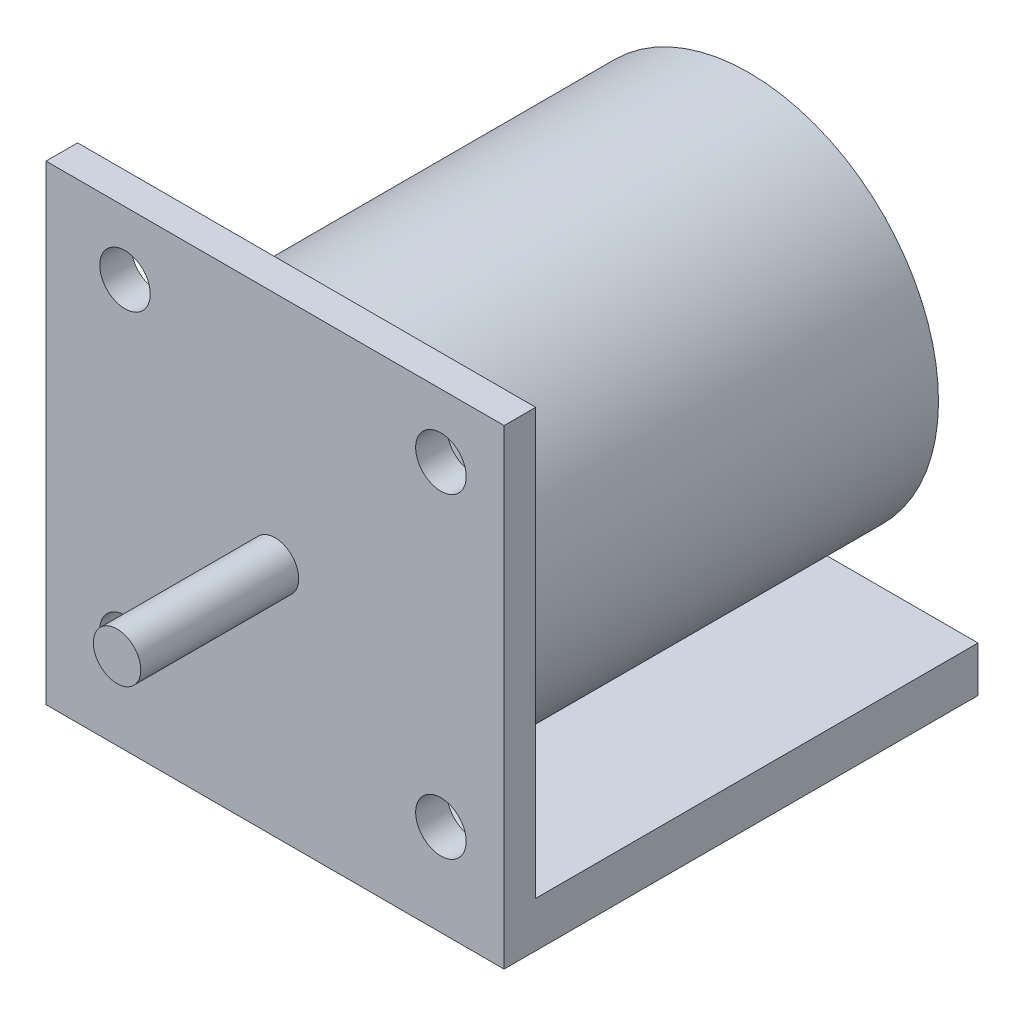
ISO-10303-21;
HEADER;
FILE_DESCRIPTION(('STEP AP214'),'2;1');
FILE_NAME('part.step','',(''),(''),'','','');
FILE_SCHEMA(('AUTOMOTIVE_DESIGN { 1 0 10303 214 1 1 1 1 }'));
ENDSEC;
DATA;
#1=APPLICATION_CONTEXT('core data for automotive mechanical design processes');
#2=APPLICATION_PROTOCOL_DEFINITION('international standard','automotive_design',2000,#1);
#3=PRODUCT_CONTEXT('',#1,'mechanical');
#4=PRODUCT('Part','Part','',(#3));
#5=PRODUCT_RELATED_PRODUCT_CATEGORY('part','',(#4));
#6=PRODUCT_DEFINITION_FORMATION('','',#4);
#7=PRODUCT_DEFINITION_CONTEXT('part definition',#1,'design');
#8=PRODUCT_DEFINITION('design','',#6,#7);
#9=PRODUCT_DEFINITION_SHAPE('','',#8);
#10=(LENGTH_UNIT() NAMED_UNIT(*) SI_UNIT(.MILLI.,.METRE.));
#11=(NAMED_UNIT(*) PLANE_ANGLE_UNIT() SI_UNIT($,.RADIAN.));
#12=(NAMED_UNIT(*) SI_UNIT($,.STERADIAN.) SOLID_ANGLE_UNIT());
#13=UNCERTAINTY_MEASURE_WITH_UNIT(LENGTH_MEASURE(1.E-05),#10,'distance_accuracy_value','');
#14=(GEOMETRIC_REPRESENTATION_CONTEXT(3) GLOBAL_UNCERTAINTY_ASSIGNED_CONTEXT((#13)) GLOBAL_UNIT_ASSIGNED_CONTEXT((#10,
#11,#12)) REPRESENTATION_CONTEXT('',''));
#15=CARTESIAN_POINT('',(0.,0.,0.));
#16=DIRECTION('',(0.,0.,1.));
#17=DIRECTION('',(1.,0.,0.));
#18=AXIS2_PLACEMENT_3D('',#15,#16,#17);
#19=CARTESIAN_POINT('',(0.,0.,0.));
#20=DIRECTION('',(0.,0.,-1.));
#21=DIRECTION('',(-1.,0.,0.));
#22=AXIS2_PLACEMENT_3D('',#19,#20,#21);
#23=PLANE('',#22);
#24=CARTESIAN_POINT('',(-12.0649999999997,-11.5570000000002,0.));
#25=DIRECTION('',(0.,0.,-1.));
#26=DIRECTION('',(-1.,0.,0.));
#27=AXIS2_PLACEMENT_3D('',#24,#25,#26);
#28=CIRCLE('',#27,2.032);
#29=CARTESIAN_POINT('',(-10.0348667645362,-11.4699193117478,0.));
#30=VERTEX_POINT('',#29);
#31=CARTESIAN_POINT('',(-11.890722626426,-9.5324873680168,0.));
#32=VERTEX_POINT('',#31);
#33=EDGE_CURVE('E112',#30,#32,#28,.T.);
#34=ORIENTED_EDGE('',*,*,#33,.F.);
#35=CARTESIAN_POINT('',(0.,0.,0.));
#36=DIRECTION('',(0.,0.,-1.));
#37=DIRECTION('',(-1.,0.,0.));
#38=AXIS2_PLACEMENT_3D('',#35,#36,#37);
#39=CIRCLE('',#38,15.24);
#40=EDGE_CURVE('E119',#32,#30,#39,.T.);
#41=ORIENTED_EDGE('',*,*,#40,.F.);
#42=EDGE_LOOP('',(#34,#41));
#43=FACE_BOUND('',#42,.T.);
#44=CARTESIAN_POINT('',(13.3350000000003,-11.557,0.));
#45=DIRECTION('',(0.,0.,-1.));
#46=DIRECTION('',(-1.,0.,0.));
#47=AXIS2_PLACEMENT_3D('',#44,#45,#46);
#48=CIRCLE('',#47,2.032);
#49=CARTESIAN_POINT('',(11.3030000000003,-11.557,0.));
#50=VERTEX_POINT('',#49);
#51=EDGE_CURVE('E333',#50,#50,#48,.T.);
#52=ORIENTED_EDGE('',*,*,#51,.F.);
#53=EDGE_LOOP('',(#52));
#54=FACE_BOUND('',#53,.T.);
#55=CARTESIAN_POINT('',(-12.065,13.8429999999998,0.));
#56=DIRECTION('',(0.,0.,-1.));
#57=DIRECTION('',(-1.,0.,0.));
#58=AXIS2_PLACEMENT_3D('',#55,#56,#57);
#59=CIRCLE('',#58,2.032);
#60=CARTESIAN_POINT('',(-14.097,13.8429999999998,0.));
#61=VERTEX_POINT('',#60);
#62=EDGE_CURVE('E339',#61,#61,#59,.T.);
#63=ORIENTED_EDGE('',*,*,#62,.F.);
#64=EDGE_LOOP('',(#63));
#65=FACE_BOUND('',#64,.T.);
#66=CARTESIAN_POINT('',(13.335,13.843,0.));
#67=DIRECTION('',(0.,0.,-1.));
#68=DIRECTION('',(-1.,0.,0.));
#69=AXIS2_PLACEMENT_3D('',#66,#67,#68);
#70=CIRCLE('',#69,2.032);
#71=CARTESIAN_POINT('',(11.303,13.843,0.));
#72=VERTEX_POINT('',#71);
#73=EDGE_CURVE('E345',#72,#72,#70,.T.);
#74=ORIENTED_EDGE('',*,*,#73,.F.);
#75=EDGE_LOOP('',(#74));
#76=FACE_BOUND('',#75,.T.);
#77=DIRECTION('',(0.,1.,0.));
#78=VECTOR('',#77,1.);
#79=CARTESIAN_POINT('',(18.415,-18.923,0.));
#80=LINE('',#79,#78);
#81=CARTESIAN_POINT('',(18.415,-15.2655964007522,0.));
#82=VERTEX_POINT('',#81);
#83=CARTESIAN_POINT('',(18.415,18.923,0.));
#84=VERTEX_POINT('',#83);
#85=EDGE_CURVE('E132',#82,#84,#80,.T.);
#86=ORIENTED_EDGE('',*,*,#85,.F.);
#87=DIRECTION('',(1.,0.,0.));
#88=VECTOR('',#87,1.);
#89=CARTESIAN_POINT('',(-18.415,-15.2655964007522,0.));
#90=LINE('',#89,#88);
#91=CARTESIAN_POINT('',(-18.415,-15.2655964007522,0.));
#92=VERTEX_POINT('',#91);
#93=EDGE_CURVE('E348',#92,#82,#90,.T.);
#94=ORIENTED_EDGE('',*,*,#93,.F.);
#95=DIRECTION('',(0.,-1.,0.));
#96=VECTOR('',#95,1.);
#97=CARTESIAN_POINT('',(-18.415,-18.923,0.));
#98=LINE('',#97,#96);
#99=CARTESIAN_POINT('',(-18.415,18.923,0.));
#100=VERTEX_POINT('',#99);
#101=EDGE_CURVE('E135',#100,#92,#98,.T.);
#102=ORIENTED_EDGE('',*,*,#101,.F.);
#103=DIRECTION('',(-1.,0.,0.));
#104=VECTOR('',#103,1.);
#105=CARTESIAN_POINT('',(-18.415,18.923,0.));
#106=LINE('',#105,#104);
#107=EDGE_CURVE('E71',#84,#100,#106,.T.);
#108=ORIENTED_EDGE('',*,*,#107,.F.);
#109=EDGE_LOOP('',(#86,#94,#102,#108));
#110=FACE_BOUND('',#109,.T.);
#111=ADVANCED_FACE('F32',(#43,#54,#65,#76,#110),#23,.T.);
#112=CARTESIAN_POINT('',(0.,0.,2.54));
#113=DIRECTION('',(0.,0.,-1.));
#114=DIRECTION('',(-1.,0.,0.));
#115=AXIS2_PLACEMENT_3D('',#112,#113,#114);
#116=PLANE('',#115);
#117=CARTESIAN_POINT('',(-12.0649999999997,-11.5570000000002,2.54));
#118=DIRECTION('',(0.,0.,1.));
#119=DIRECTION('',(1.,0.,0.));
#120=AXIS2_PLACEMENT_3D('',#117,#118,#119);
#121=CIRCLE('',#120,2.032);
#122=CARTESIAN_POINT('',(-10.0329999999997,-11.5570000000002,2.54));
#123=VERTEX_POINT('',#122);
#124=EDGE_CURVE('E113',#123,#123,#121,.T.);
#125=ORIENTED_EDGE('',*,*,#124,.F.);
#126=EDGE_LOOP('',(#125));
#127=FACE_BOUND('',#126,.T.);
#128=CARTESIAN_POINT('',(13.3350000000003,-11.557,2.54));
#129=DIRECTION('',(0.,0.,1.));
#130=DIRECTION('',(1.,0.,0.));
#131=AXIS2_PLACEMENT_3D('',#128,#129,#130);
#132=CIRCLE('',#131,2.032);
#133=CARTESIAN_POINT('',(15.3670000000003,-11.557,2.54));
#134=VERTEX_POINT('',#133);
#135=EDGE_CURVE('E330',#134,#134,#132,.T.);
#136=ORIENTED_EDGE('',*,*,#135,.F.);
#137=EDGE_LOOP('',(#136));
#138=FACE_BOUND('',#137,.T.);
#139=CARTESIAN_POINT('',(-12.065,13.8429999999998,2.54));
#140=DIRECTION('',(0.,0.,1.));
#141=DIRECTION('',(1.,0.,0.));
#142=AXIS2_PLACEMENT_3D('',#139,#140,#141);
#143=CIRCLE('',#142,2.032);
#144=CARTESIAN_POINT('',(-10.033,13.8429999999998,2.54));
#145=VERTEX_POINT('',#144);
#146=EDGE_CURVE('E336',#145,#145,#143,.T.);
#147=ORIENTED_EDGE('',*,*,#146,.F.);
#148=EDGE_LOOP('',(#147));
#149=FACE_BOUND('',#148,.T.);
#150=CARTESIAN_POINT('',(13.335,13.843,2.54));
#151=DIRECTION('',(0.,0.,1.));
#152=DIRECTION('',(1.,0.,0.));
#153=AXIS2_PLACEMENT_3D('',#150,#151,#152);
#154=CIRCLE('',#153,2.032);
#155=CARTESIAN_POINT('',(15.367,13.843,2.54));
#156=VERTEX_POINT('',#155);
#157=EDGE_CURVE('E342',#156,#156,#154,.T.);
#158=ORIENTED_EDGE('',*,*,#157,.F.);
#159=EDGE_LOOP('',(#158));
#160=FACE_BOUND('',#159,.T.);
#161=DIRECTION('',(0.,1.,0.));
#162=VECTOR('',#161,1.);
#163=CARTESIAN_POINT('',(18.415,-18.923,2.54));
#164=LINE('',#163,#162);
#165=CARTESIAN_POINT('',(18.415,-18.923,2.54));
#166=VERTEX_POINT('',#165);
#167=CARTESIAN_POINT('',(18.415,18.923,2.54));
#168=VERTEX_POINT('',#167);
#169=EDGE_CURVE('E133',#166,#168,#164,.T.);
#170=ORIENTED_EDGE('',*,*,#169,.T.);
#171=DIRECTION('',(-1.,0.,0.));
#172=VECTOR('',#171,1.);
#173=CARTESIAN_POINT('',(-18.415,18.923,2.54));
#174=LINE('',#173,#172);
#175=CARTESIAN_POINT('',(-18.415,18.923,2.54));
#176=VERTEX_POINT('',#175);
#177=EDGE_CURVE('E76',#168,#176,#174,.T.);
#178=ORIENTED_EDGE('',*,*,#177,.T.);
#179=DIRECTION('',(0.,-1.,0.));
#180=VECTOR('',#179,1.);
#181=CARTESIAN_POINT('',(-18.415,-18.923,2.54));
#182=LINE('',#181,#180);
#183=CARTESIAN_POINT('',(-18.415,-18.923,2.54));
#184=VERTEX_POINT('',#183);
#185=EDGE_CURVE('E137',#176,#184,#182,.T.);
#186=ORIENTED_EDGE('',*,*,#185,.T.);
#187=DIRECTION('',(1.,0.,0.));
#188=VECTOR('',#187,1.);
#189=CARTESIAN_POINT('',(-18.415,-18.923,2.54));
#190=LINE('',#189,#188);
#191=EDGE_CURVE('E55',#184,#166,#190,.T.);
#192=ORIENTED_EDGE('',*,*,#191,.T.);
#193=EDGE_LOOP('',(#170,#178,#186,#192));
#194=FACE_BOUND('',#193,.T.);
#195=CARTESIAN_POINT('',(0.,0.,2.54));
#196=DIRECTION('',(0.,0.,-1.));
#197=DIRECTION('',(-1.,0.,0.));
#198=AXIS2_PLACEMENT_3D('',#195,#196,#197);
#199=CIRCLE('',#198,1.905);
#200=CARTESIAN_POINT('',(-1.905,0.,2.54));
#201=VERTEX_POINT('',#200);
#202=EDGE_CURVE('E107',#201,#201,#199,.F.);
#203=ORIENTED_EDGE('',*,*,#202,.F.);
#204=EDGE_LOOP('',(#203));
#205=FACE_BOUND('',#204,.T.);
#206=ADVANCED_FACE('F157',(#127,#138,#149,#160,#194,#205),#116,.F.);
#207=CARTESIAN_POINT('',(18.415,-18.923,2.54));
#208=DIRECTION('',(-1.,0.,0.));
#209=DIRECTION('',(0.,0.,1.));
#210=AXIS2_PLACEMENT_3D('',#207,#208,#209);
#211=PLANE('',#210);
#212=DIRECTION('',(0.,0.,-1.));
#213=VECTOR('',#212,1.);
#214=CARTESIAN_POINT('',(18.415,-18.923,2.54));
#215=LINE('',#214,#213);
#216=CARTESIAN_POINT('',(18.415,-18.923,-35.56));
#217=VERTEX_POINT('',#216);
#218=EDGE_CURVE('E140',#166,#217,#215,.T.);
#219=ORIENTED_EDGE('',*,*,#218,.T.);
#220=DIRECTION('',(0.,-1.,0.));
#221=VECTOR('',#220,1.);
#222=CARTESIAN_POINT('',(18.415,-18.923,-35.56));
#223=LINE('',#222,#221);
#224=CARTESIAN_POINT('',(18.415,-15.2655964007522,-35.56));
#225=VERTEX_POINT('',#224);
#226=EDGE_CURVE('E354',#225,#217,#223,.T.);
#227=ORIENTED_EDGE('',*,*,#226,.F.);
#228=DIRECTION('',(0.,0.,1.));
#229=VECTOR('',#228,1.);
#230=CARTESIAN_POINT('',(18.415,-15.2655964007522,-35.56));
#231=LINE('',#230,#229);
#232=EDGE_CURVE('E127',#225,#82,#231,.T.);
#233=ORIENTED_EDGE('',*,*,#232,.T.);
#234=ORIENTED_EDGE('',*,*,#85,.T.);
#235=DIRECTION('',(0.,0.,-1.));
#236=VECTOR('',#235,1.);
#237=CARTESIAN_POINT('',(18.415,18.923,2.54));
#238=LINE('',#237,#236);
#239=EDGE_CURVE('E150',#168,#84,#238,.T.);
#240=ORIENTED_EDGE('',*,*,#239,.F.);
#241=ORIENTED_EDGE('',*,*,#169,.F.);
#242=EDGE_LOOP('',(#219,#227,#233,#234,#240,#241));
#243=FACE_BOUND('',#242,.T.);
#244=ADVANCED_FACE('F34',(#243),#211,.F.);
#245=CARTESIAN_POINT('',(-18.415,18.923,2.54));
#246=DIRECTION('',(0.,-1.,0.));
#247=DIRECTION('',(0.,0.,-1.));
#248=AXIS2_PLACEMENT_3D('',#245,#246,#247);
#249=PLANE('',#248);
#250=ORIENTED_EDGE('',*,*,#107,.T.);
#251=DIRECTION('',(0.,0.,-1.));
#252=VECTOR('',#251,1.);
#253=CARTESIAN_POINT('',(-18.415,18.923,2.54));
#254=LINE('',#253,#252);
#255=EDGE_CURVE('E148',#176,#100,#254,.T.);
#256=ORIENTED_EDGE('',*,*,#255,.F.);
#257=ORIENTED_EDGE('',*,*,#177,.F.);
#258=ORIENTED_EDGE('',*,*,#239,.T.);
#259=EDGE_LOOP('',(#250,#256,#257,#258));
#260=FACE_BOUND('',#259,.T.);
#261=ADVANCED_FACE('F165',(#260),#249,.F.);
#262=CARTESIAN_POINT('',(-18.415,-18.923,2.54));
#263=DIRECTION('',(1.,0.,0.));
#264=DIRECTION('',(0.,0.,-1.));
#265=AXIS2_PLACEMENT_3D('',#262,#263,#264);
#266=PLANE('',#265);
#267=ORIENTED_EDGE('',*,*,#101,.T.);
#268=DIRECTION('',(0.,0.,1.));
#269=VECTOR('',#268,1.);
#270=CARTESIAN_POINT('',(-18.415,-15.2655964007522,-35.56));
#271=LINE('',#270,#269);
#272=CARTESIAN_POINT('',(-18.415,-15.2655964007522,-35.56));
#273=VERTEX_POINT('',#272);
#274=EDGE_CURVE('E122',#273,#92,#271,.T.);
#275=ORIENTED_EDGE('',*,*,#274,.F.);
#276=DIRECTION('',(0.,1.,0.));
#277=VECTOR('',#276,1.);
#278=CARTESIAN_POINT('',(-18.415,-18.923,-35.56));
#279=LINE('',#278,#277);
#280=CARTESIAN_POINT('',(-18.415,-18.923,-35.56));
#281=VERTEX_POINT('',#280);
#282=EDGE_CURVE('E349',#281,#273,#279,.T.);
#283=ORIENTED_EDGE('',*,*,#282,.F.);
#284=DIRECTION('',(0.,0.,-1.));
#285=VECTOR('',#284,1.);
#286=CARTESIAN_POINT('',(-18.415,-18.923,2.54));
#287=LINE('',#286,#285);
#288=EDGE_CURVE('E146',#184,#281,#287,.T.);
#289=ORIENTED_EDGE('',*,*,#288,.F.);
#290=ORIENTED_EDGE('',*,*,#185,.F.);
#291=ORIENTED_EDGE('',*,*,#255,.T.);
#292=EDGE_LOOP('',(#267,#275,#283,#289,#290,#291));
#293=FACE_BOUND('',#292,.T.);
#294=ADVANCED_FACE('F176',(#293),#266,.F.);
#295=CARTESIAN_POINT('',(-18.415,-18.923,2.54));
#296=DIRECTION('',(0.,1.,0.));
#297=DIRECTION('',(0.,0.,1.));
#298=AXIS2_PLACEMENT_3D('',#295,#296,#297);
#299=PLANE('',#298);
#300=ORIENTED_EDGE('',*,*,#288,.T.);
#301=DIRECTION('',(-1.,0.,0.));
#302=VECTOR('',#301,1.);
#303=CARTESIAN_POINT('',(-18.415,-18.923,-35.56));
#304=LINE('',#303,#302);
#305=EDGE_CURVE('E357',#217,#281,#304,.T.);
#306=ORIENTED_EDGE('',*,*,#305,.F.);
#307=ORIENTED_EDGE('',*,*,#218,.F.);
#308=ORIENTED_EDGE('',*,*,#191,.F.);
#309=EDGE_LOOP('',(#300,#306,#307,#308));
#310=FACE_BOUND('',#309,.T.);
#311=ADVANCED_FACE('F173',(#310),#299,.F.);
#312=CARTESIAN_POINT('',(0.,0.,15.24));
#313=DIRECTION('',(0.,0.,-1.));
#314=DIRECTION('',(-1.,0.,0.));
#315=AXIS2_PLACEMENT_3D('',#312,#313,#314);
#316=CYLINDRICAL_SURFACE('',#315,1.905);
#317=CARTESIAN_POINT('',(0.,0.,15.24));
#318=DIRECTION('',(0.,0.,1.));
#319=DIRECTION('',(1.,0.,0.));
#320=AXIS2_PLACEMENT_3D('',#317,#318,#319);
#321=CIRCLE('',#320,1.905);
#322=CARTESIAN_POINT('',(1.905,0.,15.24));
#323=VERTEX_POINT('',#322);
#324=EDGE_CURVE('E125',#323,#323,#321,.T.);
#325=ORIENTED_EDGE('',*,*,#324,.F.);
#326=EDGE_LOOP('',(#325));
#327=FACE_BOUND('',#326,.T.);
#328=ORIENTED_EDGE('',*,*,#202,.T.);
#329=EDGE_LOOP('',(#328));
#330=FACE_BOUND('',#329,.T.);
#331=ADVANCED_FACE('F155',(#327,#330),#316,.T.);
#332=CARTESIAN_POINT('',(0.,0.,15.24));
#333=DIRECTION('',(0.,0.,1.));
#334=DIRECTION('',(1.,0.,0.));
#335=AXIS2_PLACEMENT_3D('',#332,#333,#334);
#336=PLANE('',#335);
#337=ORIENTED_EDGE('',*,*,#324,.T.);
#338=EDGE_LOOP('',(#337));
#339=FACE_BOUND('',#338,.T.);
#340=ADVANCED_FACE('F200',(#339),#336,.T.);
#341=CARTESIAN_POINT('',(0.,0.,-35.56));
#342=DIRECTION('',(0.,0.,1.));
#343=DIRECTION('',(1.,0.,0.));
#344=AXIS2_PLACEMENT_3D('',#341,#342,#343);
#345=CYLINDRICAL_SURFACE('',#344,15.24);
#346=ORIENTED_EDGE('',*,*,#40,.T.);
#347=DIRECTION('',(0.,0.,1.));
#348=VECTOR('',#347,1.);
#349=CARTESIAN_POINT('',(-10.0348667645362,-11.4699193117478,-15.24));
#350=LINE('',#349,#348);
#351=CARTESIAN_POINT('',(-10.0348667645362,-11.4699193117478,-33.02));
#352=VERTEX_POINT('',#351);
#353=EDGE_CURVE('E11',#30,#352,#350,.F.);
#354=ORIENTED_EDGE('',*,*,#353,.T.);
#355=CARTESIAN_POINT('',(0.,0.,-33.02));
#356=DIRECTION('',(0.,0.,1.));
#357=DIRECTION('',(1.,0.,0.));
#358=AXIS2_PLACEMENT_3D('',#355,#356,#357);
#359=CIRCLE('',#358,15.24);
#360=CARTESIAN_POINT('',(-11.890722626426,-9.53248736801681,-33.02));
#361=VERTEX_POINT('',#360);
#362=EDGE_CURVE('E103',#361,#352,#359,.T.);
#363=ORIENTED_EDGE('',*,*,#362,.F.);
#364=DIRECTION('',(0.,0.,1.));
#365=VECTOR('',#364,1.);
#366=CARTESIAN_POINT('',(-11.890722626426,-9.53248736801681,-15.24));
#367=LINE('',#366,#365);
#368=EDGE_CURVE('E40',#361,#32,#367,.T.);
#369=ORIENTED_EDGE('',*,*,#368,.T.);
#370=EDGE_LOOP('',(#346,#354,#363,#369));
#371=FACE_BOUND('',#370,.T.);
#372=CARTESIAN_POINT('',(0.,0.,-35.56));
#373=DIRECTION('',(0.,0.,-1.));
#374=DIRECTION('',(-1.,0.,0.));
#375=AXIS2_PLACEMENT_3D('',#372,#373,#374);
#376=CIRCLE('',#375,15.24);
#377=CARTESIAN_POINT('',(-15.24,0.,-35.56));
#378=VERTEX_POINT('',#377);
#379=EDGE_CURVE('E121',#378,#378,#376,.T.);
#380=ORIENTED_EDGE('',*,*,#379,.F.);
#381=EDGE_LOOP('',(#380));
#382=FACE_BOUND('',#381,.T.);
#383=ADVANCED_FACE('F116',(#371,#382),#345,.T.);
#384=CARTESIAN_POINT('',(0.,0.,-35.56));
#385=DIRECTION('',(0.,0.,-1.));
#386=DIRECTION('',(-1.,0.,0.));
#387=AXIS2_PLACEMENT_3D('',#384,#385,#386);
#388=PLANE('',#387);
#389=ORIENTED_EDGE('',*,*,#379,.T.);
#390=EDGE_LOOP('',(#389));
#391=FACE_BOUND('',#390,.T.);
#392=ADVANCED_FACE('F214',(#391),#388,.T.);
#393=CARTESIAN_POINT('',(-18.415,-15.2655964007522,-35.56));
#394=DIRECTION('',(0.,-1.,0.));
#395=DIRECTION('',(0.,0.,-1.));
#396=AXIS2_PLACEMENT_3D('',#393,#394,#395);
#397=PLANE('',#396);
#398=ORIENTED_EDGE('',*,*,#93,.T.);
#399=ORIENTED_EDGE('',*,*,#232,.F.);
#400=DIRECTION('',(1.,0.,0.));
#401=VECTOR('',#400,1.);
#402=CARTESIAN_POINT('',(-18.415,-15.2655964007522,-35.56));
#403=LINE('',#402,#401);
#404=EDGE_CURVE('E352',#273,#225,#403,.T.);
#405=ORIENTED_EDGE('',*,*,#404,.F.);
#406=ORIENTED_EDGE('',*,*,#274,.T.);
#407=EDGE_LOOP('',(#398,#399,#405,#406));
#408=FACE_BOUND('',#407,.T.);
#409=ADVANCED_FACE('F221',(#408),#397,.F.);
#410=CARTESIAN_POINT('',(0.,0.,-35.56));
#411=DIRECTION('',(0.,0.,-1.));
#412=DIRECTION('',(-1.,0.,0.));
#413=AXIS2_PLACEMENT_3D('',#410,#411,#412);
#414=PLANE('',#413);
#415=ORIENTED_EDGE('',*,*,#282,.T.);
#416=ORIENTED_EDGE('',*,*,#404,.T.);
#417=ORIENTED_EDGE('',*,*,#226,.T.);
#418=ORIENTED_EDGE('',*,*,#305,.T.);
#419=EDGE_LOOP('',(#415,#416,#417,#418));
#420=FACE_BOUND('',#419,.T.);
#421=ADVANCED_FACE('F228',(#420),#414,.T.);
#422=CARTESIAN_POINT('',(13.335,13.843,-33.02));
#423=DIRECTION('',(0.,0.,1.));
#424=DIRECTION('',(1.,0.,0.));
#425=AXIS2_PLACEMENT_3D('',#422,#423,#424);
#426=CYLINDRICAL_SURFACE('',#425,2.032);
#427=ORIENTED_EDGE('',*,*,#73,.T.);
#428=EDGE_LOOP('',(#427));
#429=FACE_BOUND('',#428,.T.);
#430=ORIENTED_EDGE('',*,*,#157,.T.);
#431=EDGE_LOOP('',(#430));
#432=FACE_BOUND('',#431,.T.);
#433=ADVANCED_FACE('F236',(#429,#432),#426,.F.);
#434=CARTESIAN_POINT('',(-12.065,13.8429999999998,-33.02));
#435=DIRECTION('',(0.,0.,1.));
#436=DIRECTION('',(1.,0.,0.));
#437=AXIS2_PLACEMENT_3D('',#434,#435,#436);
#438=CYLINDRICAL_SURFACE('',#437,2.032);
#439=ORIENTED_EDGE('',*,*,#62,.T.);
#440=EDGE_LOOP('',(#439));
#441=FACE_BOUND('',#440,.T.);
#442=ORIENTED_EDGE('',*,*,#146,.T.);
#443=EDGE_LOOP('',(#442));
#444=FACE_BOUND('',#443,.T.);
#445=ADVANCED_FACE('F244',(#441,#444),#438,.F.);
#446=CARTESIAN_POINT('',(13.3350000000003,-11.557,-33.02));
#447=DIRECTION('',(0.,0.,1.));
#448=DIRECTION('',(1.,0.,0.));
#449=AXIS2_PLACEMENT_3D('',#446,#447,#448);
#450=CYLINDRICAL_SURFACE('',#449,2.032);
#451=ORIENTED_EDGE('',*,*,#51,.T.);
#452=EDGE_LOOP('',(#451));
#453=FACE_BOUND('',#452,.T.);
#454=ORIENTED_EDGE('',*,*,#135,.T.);
#455=EDGE_LOOP('',(#454));
#456=FACE_BOUND('',#455,.T.);
#457=ADVANCED_FACE('F252',(#453,#456),#450,.F.);
#458=CARTESIAN_POINT('',(-12.0649999999997,-11.5570000000002,-33.02));
#459=DIRECTION('',(0.,0.,1.));
#460=DIRECTION('',(1.,0.,0.));
#461=AXIS2_PLACEMENT_3D('',#458,#459,#460);
#462=CYLINDRICAL_SURFACE('',#461,2.032);
#463=ORIENTED_EDGE('',*,*,#124,.T.);
#464=EDGE_LOOP('',(#463));
#465=FACE_BOUND('',#464,.T.);
#466=ORIENTED_EDGE('',*,*,#33,.T.);
#467=ORIENTED_EDGE('',*,*,#368,.F.);
#468=CARTESIAN_POINT('',(-12.0649999999997,-11.5570000000002,-33.02));
#469=DIRECTION('',(0.,0.,1.));
#470=DIRECTION('',(1.,0.,0.));
#471=AXIS2_PLACEMENT_3D('',#468,#469,#470);
#472=CIRCLE('',#471,2.032);
#473=EDGE_CURVE('E46',#352,#361,#472,.T.);
#474=ORIENTED_EDGE('',*,*,#473,.F.);
#475=ORIENTED_EDGE('',*,*,#353,.F.);
#476=EDGE_LOOP('',(#466,#467,#474,#475));
#477=FACE_BOUND('',#476,.T.);
#478=ADVANCED_FACE('F110',(#465,#477),#462,.F.);
#479=CARTESIAN_POINT('',(-12.0649999999997,-11.5570000000002,-33.02));
#480=DIRECTION('',(0.,0.,1.));
#481=DIRECTION('',(1.,0.,0.));
#482=AXIS2_PLACEMENT_3D('',#479,#480,#481);
#483=PLANE('',#482);
#484=ORIENTED_EDGE('',*,*,#362,.T.);
#485=ORIENTED_EDGE('',*,*,#473,.T.);
#486=EDGE_LOOP('',(#484,#485));
#487=FACE_BOUND('',#486,.T.);
#488=ADVANCED_FACE('F104',(#487),#483,.T.);
#489=CLOSED_SHELL('',(#111,#206,#244,#261,#294,#311,#331,#340,#383,#392,#409,#421,#433,#445,
#457,#478,#488));
#490=MANIFOLD_SOLID_BREP('B2',#489);
#491=ADVANCED_BREP_SHAPE_REPRESENTATION('',(#18,#490),#14);
#492=SHAPE_DEFINITION_REPRESENTATION(#9,#491);
ENDSEC;
END-ISO-10303-21;
